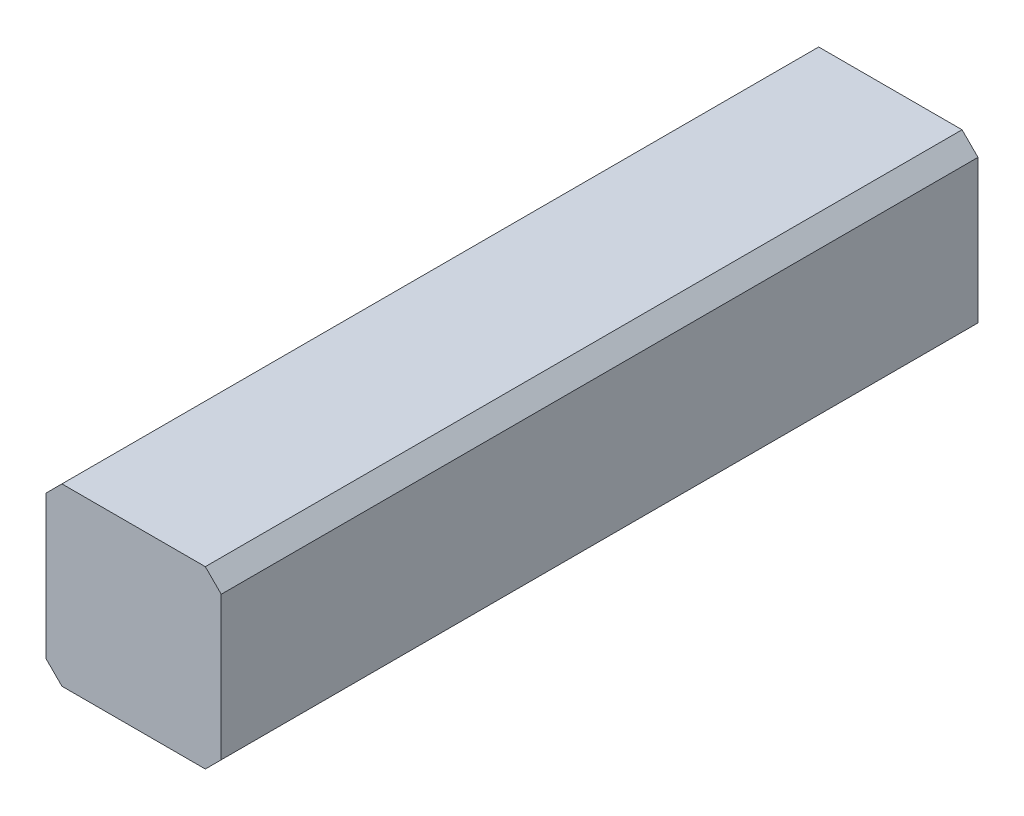
ISO-10303-21;
HEADER;
FILE_DESCRIPTION(('STEP AP214'),'2;1');
FILE_NAME('part.step','',(''),(''),'','','');
FILE_SCHEMA(('AUTOMOTIVE_DESIGN { 1 0 10303 214 1 1 1 1 }'));
ENDSEC;
DATA;
#1=APPLICATION_CONTEXT('core data for automotive mechanical design processes');
#2=APPLICATION_PROTOCOL_DEFINITION('international standard','automotive_design',2000,#1);
#3=PRODUCT_CONTEXT('',#1,'mechanical');
#4=PRODUCT('Part','Part','',(#3));
#5=PRODUCT_RELATED_PRODUCT_CATEGORY('part','',(#4));
#6=PRODUCT_DEFINITION_FORMATION('','',#4);
#7=PRODUCT_DEFINITION_CONTEXT('part definition',#1,'design');
#8=PRODUCT_DEFINITION('design','',#6,#7);
#9=PRODUCT_DEFINITION_SHAPE('','',#8);
#10=(LENGTH_UNIT() NAMED_UNIT(*) SI_UNIT(.MILLI.,.METRE.));
#11=(NAMED_UNIT(*) PLANE_ANGLE_UNIT() SI_UNIT($,.RADIAN.));
#12=(NAMED_UNIT(*) SI_UNIT($,.STERADIAN.) SOLID_ANGLE_UNIT());
#13=UNCERTAINTY_MEASURE_WITH_UNIT(LENGTH_MEASURE(1.E-05),#10,'distance_accuracy_value','');
#14=(GEOMETRIC_REPRESENTATION_CONTEXT(3) GLOBAL_UNCERTAINTY_ASSIGNED_CONTEXT((#13)) GLOBAL_UNIT_ASSIGNED_CONTEXT((#10,
#11,#12)) REPRESENTATION_CONTEXT('',''));
#15=CARTESIAN_POINT('',(0.,0.,0.));
#16=DIRECTION('',(0.,0.,1.));
#17=DIRECTION('',(1.,0.,0.));
#18=AXIS2_PLACEMENT_3D('',#15,#16,#17);
#19=CARTESIAN_POINT('',(-9.,11.,95.));
#20=DIRECTION('',(0.,-1.,0.));
#21=DIRECTION('',(0.,0.,-1.));
#22=AXIS2_PLACEMENT_3D('',#19,#20,#21);
#23=PLANE('',#22);
#24=DIRECTION('',(-1.,0.,0.));
#25=VECTOR('',#24,1.);
#26=CARTESIAN_POINT('',(-9.,11.,0.));
#27=LINE('',#26,#25);
#28=CARTESIAN_POINT('',(9.,11.,0.));
#29=VERTEX_POINT('',#28);
#30=CARTESIAN_POINT('',(-9.,11.,0.));
#31=VERTEX_POINT('',#30);
#32=EDGE_CURVE('E129',#29,#31,#27,.T.);
#33=ORIENTED_EDGE('',*,*,#32,.T.);
#34=DIRECTION('',(0.,0.,-1.));
#35=VECTOR('',#34,1.);
#36=CARTESIAN_POINT('',(-9.,11.,95.));
#37=LINE('',#36,#35);
#38=CARTESIAN_POINT('',(-9.,11.,95.));
#39=VERTEX_POINT('',#38);
#40=EDGE_CURVE('E11',#39,#31,#37,.T.);
#41=ORIENTED_EDGE('',*,*,#40,.F.);
#42=DIRECTION('',(-1.,0.,0.));
#43=VECTOR('',#42,1.);
#44=CARTESIAN_POINT('',(-9.,11.,95.));
#45=LINE('',#44,#43);
#46=CARTESIAN_POINT('',(9.,11.,95.));
#47=VERTEX_POINT('',#46);
#48=EDGE_CURVE('E143',#47,#39,#45,.T.);
#49=ORIENTED_EDGE('',*,*,#48,.F.);
#50=DIRECTION('',(0.,0.,-1.));
#51=VECTOR('',#50,1.);
#52=CARTESIAN_POINT('',(9.,11.,95.));
#53=LINE('',#52,#51);
#54=EDGE_CURVE('E125',#47,#29,#53,.T.);
#55=ORIENTED_EDGE('',*,*,#54,.T.);
#56=EDGE_LOOP('',(#33,#41,#49,#55));
#57=FACE_BOUND('',#56,.T.);
#58=ADVANCED_FACE('F33',(#57),#23,.F.);
#59=CARTESIAN_POINT('',(-11.,9.,95.));
#60=DIRECTION('',(0.707106781186548,-0.707106781186548,0.));
#61=DIRECTION('',(0.707106781186548,0.707106781186548,0.));
#62=AXIS2_PLACEMENT_3D('',#59,#60,#61);
#63=PLANE('',#62);
#64=DIRECTION('',(-0.707106781186548,-0.707106781186548,0.));
#65=VECTOR('',#64,1.);
#66=CARTESIAN_POINT('',(-11.,9.,0.));
#67=LINE('',#66,#65);
#68=CARTESIAN_POINT('',(-11.,9.,0.));
#69=VERTEX_POINT('',#68);
#70=EDGE_CURVE('E132',#31,#69,#67,.T.);
#71=ORIENTED_EDGE('',*,*,#70,.T.);
#72=DIRECTION('',(0.,0.,-1.));
#73=VECTOR('',#72,1.);
#74=CARTESIAN_POINT('',(-11.,9.,95.));
#75=LINE('',#74,#73);
#76=CARTESIAN_POINT('',(-11.,9.,95.));
#77=VERTEX_POINT('',#76);
#78=EDGE_CURVE('E41',#77,#69,#75,.T.);
#79=ORIENTED_EDGE('',*,*,#78,.F.);
#80=DIRECTION('',(-0.707106781186548,-0.707106781186548,0.));
#81=VECTOR('',#80,1.);
#82=CARTESIAN_POINT('',(-11.,9.,95.));
#83=LINE('',#82,#81);
#84=EDGE_CURVE('E92',#39,#77,#83,.T.);
#85=ORIENTED_EDGE('',*,*,#84,.F.);
#86=ORIENTED_EDGE('',*,*,#40,.T.);
#87=EDGE_LOOP('',(#71,#79,#85,#86));
#88=FACE_BOUND('',#87,.T.);
#89=ADVANCED_FACE('F178',(#88),#63,.F.);
#90=CARTESIAN_POINT('',(-11.,9.,95.));
#91=DIRECTION('',(1.,0.,0.));
#92=DIRECTION('',(0.,1.,0.));
#93=AXIS2_PLACEMENT_3D('',#90,#91,#92);
#94=PLANE('',#93);
#95=DIRECTION('',(0.,-1.,0.));
#96=VECTOR('',#95,1.);
#97=CARTESIAN_POINT('',(-11.,9.,0.));
#98=LINE('',#97,#96);
#99=CARTESIAN_POINT('',(-11.,-9.,0.));
#100=VERTEX_POINT('',#99);
#101=EDGE_CURVE('E134',#69,#100,#98,.T.);
#102=ORIENTED_EDGE('',*,*,#101,.T.);
#103=DIRECTION('',(0.,0.,-1.));
#104=VECTOR('',#103,1.);
#105=CARTESIAN_POINT('',(-11.,-9.,95.));
#106=LINE('',#105,#104);
#107=CARTESIAN_POINT('',(-11.,-9.,95.));
#108=VERTEX_POINT('',#107);
#109=EDGE_CURVE('E150',#108,#100,#106,.T.);
#110=ORIENTED_EDGE('',*,*,#109,.F.);
#111=DIRECTION('',(0.,-1.,0.));
#112=VECTOR('',#111,1.);
#113=CARTESIAN_POINT('',(-11.,9.,95.));
#114=LINE('',#113,#112);
#115=EDGE_CURVE('E158',#77,#108,#114,.T.);
#116=ORIENTED_EDGE('',*,*,#115,.F.);
#117=ORIENTED_EDGE('',*,*,#78,.T.);
#118=EDGE_LOOP('',(#102,#110,#116,#117));
#119=FACE_BOUND('',#118,.T.);
#120=ADVANCED_FACE('F156',(#119),#94,.F.);
#121=CARTESIAN_POINT('',(-11.,-9.,95.));
#122=DIRECTION('',(0.707106781186548,0.707106781186548,0.));
#123=DIRECTION('',(-0.707106781186548,0.707106781186548,0.));
#124=AXIS2_PLACEMENT_3D('',#121,#122,#123);
#125=PLANE('',#124);
#126=DIRECTION('',(0.707106781186548,-0.707106781186548,0.));
#127=VECTOR('',#126,1.);
#128=CARTESIAN_POINT('',(-11.,-9.,0.));
#129=LINE('',#128,#127);
#130=CARTESIAN_POINT('',(-9.,-11.,0.));
#131=VERTEX_POINT('',#130);
#132=EDGE_CURVE('E136',#100,#131,#129,.T.);
#133=ORIENTED_EDGE('',*,*,#132,.T.);
#134=DIRECTION('',(0.,0.,-1.));
#135=VECTOR('',#134,1.);
#136=CARTESIAN_POINT('',(-9.,-11.,95.));
#137=LINE('',#136,#135);
#138=CARTESIAN_POINT('',(-9.,-11.,95.));
#139=VERTEX_POINT('',#138);
#140=EDGE_CURVE('E147',#139,#131,#137,.T.);
#141=ORIENTED_EDGE('',*,*,#140,.F.);
#142=DIRECTION('',(0.707106781186548,-0.707106781186548,0.));
#143=VECTOR('',#142,1.);
#144=CARTESIAN_POINT('',(-11.,-9.,95.));
#145=LINE('',#144,#143);
#146=EDGE_CURVE('E170',#108,#139,#145,.T.);
#147=ORIENTED_EDGE('',*,*,#146,.F.);
#148=ORIENTED_EDGE('',*,*,#109,.T.);
#149=EDGE_LOOP('',(#133,#141,#147,#148));
#150=FACE_BOUND('',#149,.T.);
#151=ADVANCED_FACE('F166',(#150),#125,.F.);
#152=CARTESIAN_POINT('',(-9.,-11.,95.));
#153=DIRECTION('',(0.,1.,0.));
#154=DIRECTION('',(-1.,0.,0.));
#155=AXIS2_PLACEMENT_3D('',#152,#153,#154);
#156=PLANE('',#155);
#157=DIRECTION('',(1.,0.,0.));
#158=VECTOR('',#157,1.);
#159=CARTESIAN_POINT('',(-9.,-11.,0.));
#160=LINE('',#159,#158);
#161=CARTESIAN_POINT('',(9.,-11.,0.));
#162=VERTEX_POINT('',#161);
#163=EDGE_CURVE('E138',#131,#162,#160,.T.);
#164=ORIENTED_EDGE('',*,*,#163,.T.);
#165=DIRECTION('',(0.,0.,-1.));
#166=VECTOR('',#165,1.);
#167=CARTESIAN_POINT('',(9.,-11.,95.));
#168=LINE('',#167,#166);
#169=CARTESIAN_POINT('',(9.,-11.,95.));
#170=VERTEX_POINT('',#169);
#171=EDGE_CURVE('E120',#170,#162,#168,.T.);
#172=ORIENTED_EDGE('',*,*,#171,.F.);
#173=DIRECTION('',(1.,0.,0.));
#174=VECTOR('',#173,1.);
#175=CARTESIAN_POINT('',(-9.,-11.,95.));
#176=LINE('',#175,#174);
#177=EDGE_CURVE('E111',#139,#170,#176,.T.);
#178=ORIENTED_EDGE('',*,*,#177,.F.);
#179=ORIENTED_EDGE('',*,*,#140,.T.);
#180=EDGE_LOOP('',(#164,#172,#178,#179));
#181=FACE_BOUND('',#180,.T.);
#182=ADVANCED_FACE('F169',(#181),#156,.F.);
#183=CARTESIAN_POINT('',(9.,-11.,95.));
#184=DIRECTION('',(-0.707106781186548,0.707106781186548,0.));
#185=DIRECTION('',(-0.707106781186548,-0.707106781186548,0.));
#186=AXIS2_PLACEMENT_3D('',#183,#184,#185);
#187=PLANE('',#186);
#188=DIRECTION('',(0.707106781186548,0.707106781186548,0.));
#189=VECTOR('',#188,1.);
#190=CARTESIAN_POINT('',(9.,-11.,0.));
#191=LINE('',#190,#189);
#192=CARTESIAN_POINT('',(11.,-9.,0.));
#193=VERTEX_POINT('',#192);
#194=EDGE_CURVE('E119',#162,#193,#191,.T.);
#195=ORIENTED_EDGE('',*,*,#194,.T.);
#196=DIRECTION('',(0.,0.,-1.));
#197=VECTOR('',#196,1.);
#198=CARTESIAN_POINT('',(11.,-9.,95.));
#199=LINE('',#198,#197);
#200=CARTESIAN_POINT('',(11.,-9.,95.));
#201=VERTEX_POINT('',#200);
#202=EDGE_CURVE('E116',#201,#193,#199,.T.);
#203=ORIENTED_EDGE('',*,*,#202,.F.);
#204=DIRECTION('',(0.707106781186548,0.707106781186548,0.));
#205=VECTOR('',#204,1.);
#206=CARTESIAN_POINT('',(9.,-11.,95.));
#207=LINE('',#206,#205);
#208=EDGE_CURVE('E105',#170,#201,#207,.T.);
#209=ORIENTED_EDGE('',*,*,#208,.F.);
#210=ORIENTED_EDGE('',*,*,#171,.T.);
#211=EDGE_LOOP('',(#195,#203,#209,#210));
#212=FACE_BOUND('',#211,.T.);
#213=ADVANCED_FACE('F117',(#212),#187,.F.);
#214=CARTESIAN_POINT('',(11.,9.,95.));
#215=DIRECTION('',(-1.,0.,0.));
#216=DIRECTION('',(0.,-1.,0.));
#217=AXIS2_PLACEMENT_3D('',#214,#215,#216);
#218=PLANE('',#217);
#219=DIRECTION('',(0.,1.,0.));
#220=VECTOR('',#219,1.);
#221=CARTESIAN_POINT('',(11.,9.,0.));
#222=LINE('',#221,#220);
#223=CARTESIAN_POINT('',(11.,9.,0.));
#224=VERTEX_POINT('',#223);
#225=EDGE_CURVE('E78',#193,#224,#222,.T.);
#226=ORIENTED_EDGE('',*,*,#225,.T.);
#227=DIRECTION('',(0.,0.,-1.));
#228=VECTOR('',#227,1.);
#229=CARTESIAN_POINT('',(11.,9.,95.));
#230=LINE('',#229,#228);
#231=CARTESIAN_POINT('',(11.,9.,95.));
#232=VERTEX_POINT('',#231);
#233=EDGE_CURVE('E121',#232,#224,#230,.T.);
#234=ORIENTED_EDGE('',*,*,#233,.F.);
#235=DIRECTION('',(0.,1.,0.));
#236=VECTOR('',#235,1.);
#237=CARTESIAN_POINT('',(11.,9.,95.));
#238=LINE('',#237,#236);
#239=EDGE_CURVE('E109',#201,#232,#238,.T.);
#240=ORIENTED_EDGE('',*,*,#239,.F.);
#241=ORIENTED_EDGE('',*,*,#202,.T.);
#242=EDGE_LOOP('',(#226,#234,#240,#241));
#243=FACE_BOUND('',#242,.T.);
#244=ADVANCED_FACE('F123',(#243),#218,.F.);
#245=CARTESIAN_POINT('',(9.,11.,95.));
#246=DIRECTION('',(-0.707106781186548,-0.707106781186548,0.));
#247=DIRECTION('',(0.707106781186548,-0.707106781186548,0.));
#248=AXIS2_PLACEMENT_3D('',#245,#246,#247);
#249=PLANE('',#248);
#250=DIRECTION('',(-0.707106781186548,0.707106781186548,0.));
#251=VECTOR('',#250,1.);
#252=CARTESIAN_POINT('',(9.,11.,0.));
#253=LINE('',#252,#251);
#254=EDGE_CURVE('E84',#224,#29,#253,.T.);
#255=ORIENTED_EDGE('',*,*,#254,.T.);
#256=ORIENTED_EDGE('',*,*,#54,.F.);
#257=DIRECTION('',(-0.707106781186548,0.707106781186548,0.));
#258=VECTOR('',#257,1.);
#259=CARTESIAN_POINT('',(9.,11.,95.));
#260=LINE('',#259,#258);
#261=EDGE_CURVE('E49',#232,#47,#260,.T.);
#262=ORIENTED_EDGE('',*,*,#261,.F.);
#263=ORIENTED_EDGE('',*,*,#233,.T.);
#264=EDGE_LOOP('',(#255,#256,#262,#263));
#265=FACE_BOUND('',#264,.T.);
#266=ADVANCED_FACE('F194',(#265),#249,.F.);
#267=CARTESIAN_POINT('',(0.,0.,95.));
#268=DIRECTION('',(0.,0.,-1.));
#269=DIRECTION('',(-1.,0.,0.));
#270=AXIS2_PLACEMENT_3D('',#267,#268,#269);
#271=PLANE('',#270);
#272=ORIENTED_EDGE('',*,*,#48,.T.);
#273=ORIENTED_EDGE('',*,*,#84,.T.);
#274=ORIENTED_EDGE('',*,*,#115,.T.);
#275=ORIENTED_EDGE('',*,*,#146,.T.);
#276=ORIENTED_EDGE('',*,*,#177,.T.);
#277=ORIENTED_EDGE('',*,*,#208,.T.);
#278=ORIENTED_EDGE('',*,*,#239,.T.);
#279=ORIENTED_EDGE('',*,*,#261,.T.);
#280=EDGE_LOOP('',(#272,#273,#274,#275,#276,#277,#278,#279));
#281=FACE_BOUND('',#280,.T.);
#282=ADVANCED_FACE('F107',(#281),#271,.F.);
#283=CARTESIAN_POINT('',(0.,0.,0.));
#284=DIRECTION('',(0.,0.,-1.));
#285=DIRECTION('',(-1.,0.,0.));
#286=AXIS2_PLACEMENT_3D('',#283,#284,#285);
#287=PLANE('',#286);
#288=ORIENTED_EDGE('',*,*,#32,.F.);
#289=ORIENTED_EDGE('',*,*,#254,.F.);
#290=ORIENTED_EDGE('',*,*,#225,.F.);
#291=ORIENTED_EDGE('',*,*,#194,.F.);
#292=ORIENTED_EDGE('',*,*,#163,.F.);
#293=ORIENTED_EDGE('',*,*,#132,.F.);
#294=ORIENTED_EDGE('',*,*,#101,.F.);
#295=ORIENTED_EDGE('',*,*,#70,.F.);
#296=EDGE_LOOP('',(#288,#289,#290,#291,#292,#293,#294,#295));
#297=FACE_BOUND('',#296,.T.);
#298=ADVANCED_FACE('F162',(#297),#287,.T.);
#299=CLOSED_SHELL('',(#58,#89,#120,#151,#182,#213,#244,#266,#282,#298));
#300=MANIFOLD_SOLID_BREP('B2',#299);
#301=ADVANCED_BREP_SHAPE_REPRESENTATION('',(#18,#300),#14);
#302=SHAPE_DEFINITION_REPRESENTATION(#9,#301);
ENDSEC;
END-ISO-10303-21;
